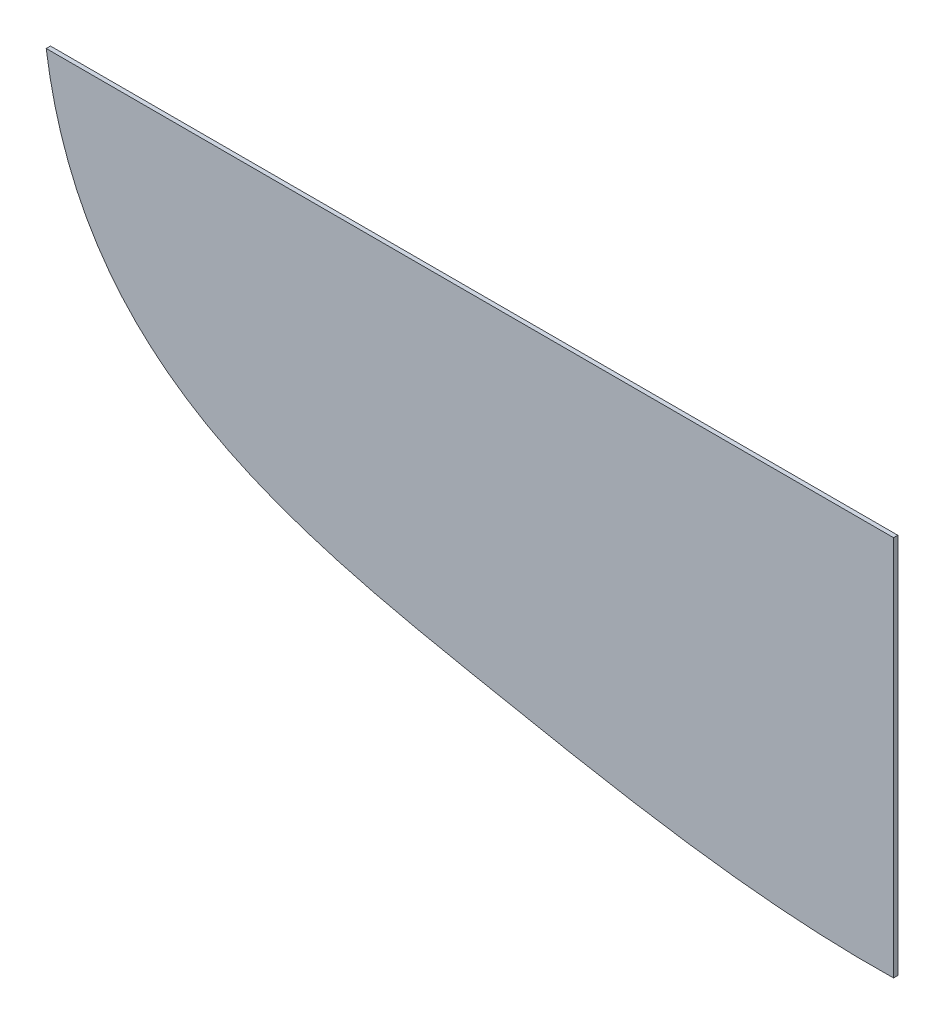
ISO-10303-21;
HEADER;
FILE_DESCRIPTION(('STEP AP214'),'2;1');
FILE_NAME('part.step','',(''),(''),'','','');
FILE_SCHEMA(('AUTOMOTIVE_DESIGN { 1 0 10303 214 1 1 1 1 }'));
ENDSEC;
DATA;
#1=APPLICATION_CONTEXT('core data for automotive mechanical design processes');
#2=APPLICATION_PROTOCOL_DEFINITION('international standard','automotive_design',2000,#1);
#3=PRODUCT_CONTEXT('',#1,'mechanical');
#4=PRODUCT('Part','Part','',(#3));
#5=PRODUCT_RELATED_PRODUCT_CATEGORY('part','',(#4));
#6=PRODUCT_DEFINITION_FORMATION('','',#4);
#7=PRODUCT_DEFINITION_CONTEXT('part definition',#1,'design');
#8=PRODUCT_DEFINITION('design','',#6,#7);
#9=PRODUCT_DEFINITION_SHAPE('','',#8);
#10=(LENGTH_UNIT() NAMED_UNIT(*) SI_UNIT(.MILLI.,.METRE.));
#11=(NAMED_UNIT(*) PLANE_ANGLE_UNIT() SI_UNIT($,.RADIAN.));
#12=(NAMED_UNIT(*) SI_UNIT($,.STERADIAN.) SOLID_ANGLE_UNIT());
#13=UNCERTAINTY_MEASURE_WITH_UNIT(LENGTH_MEASURE(1.E-05),#10,'distance_accuracy_value','');
#14=(GEOMETRIC_REPRESENTATION_CONTEXT(3) GLOBAL_UNCERTAINTY_ASSIGNED_CONTEXT((#13)) GLOBAL_UNIT_ASSIGNED_CONTEXT((#10,
#11,#12)) REPRESENTATION_CONTEXT('',''));
#15=CARTESIAN_POINT('',(0.,0.,0.));
#16=DIRECTION('',(0.,0.,1.));
#17=DIRECTION('',(1.,0.,0.));
#18=AXIS2_PLACEMENT_3D('',#15,#16,#17);
#19=CARTESIAN_POINT('',(0.,0.,0.1));
#20=DIRECTION('',(0.,-1.,0.));
#21=DIRECTION('',(0.,0.,-1.));
#22=AXIS2_PLACEMENT_3D('',#19,#20,#21);
#23=PLANE('',#22);
#24=DIRECTION('',(-1.,0.,0.));
#25=VECTOR('',#24,1.);
#26=CARTESIAN_POINT('',(0.,0.,-0.1));
#27=LINE('',#26,#25);
#28=CARTESIAN_POINT('',(0.,0.,-0.1));
#29=VERTEX_POINT('',#28);
#30=CARTESIAN_POINT('',(-40.,0.,-0.1));
#31=VERTEX_POINT('',#30);
#32=EDGE_CURVE('E85',#29,#31,#27,.T.);
#33=ORIENTED_EDGE('',*,*,#32,.T.);
#34=DIRECTION('',(0.,0.,-1.));
#35=VECTOR('',#34,1.);
#36=CARTESIAN_POINT('',(-40.,0.,0.1));
#37=LINE('',#36,#35);
#38=CARTESIAN_POINT('',(-40.,0.,0.1));
#39=VERTEX_POINT('',#38);
#40=EDGE_CURVE('E11',#39,#31,#37,.T.);
#41=ORIENTED_EDGE('',*,*,#40,.F.);
#42=DIRECTION('',(-1.,0.,0.));
#43=VECTOR('',#42,1.);
#44=CARTESIAN_POINT('',(0.,0.,0.1));
#45=LINE('',#44,#43);
#46=CARTESIAN_POINT('',(0.,0.,0.1));
#47=VERTEX_POINT('',#46);
#48=EDGE_CURVE('E78',#47,#39,#45,.T.);
#49=ORIENTED_EDGE('',*,*,#48,.F.);
#50=DIRECTION('',(0.,0.,-1.));
#51=VECTOR('',#50,1.);
#52=CARTESIAN_POINT('',(0.,0.,0.1));
#53=LINE('',#52,#51);
#54=EDGE_CURVE('E86',#47,#29,#53,.T.);
#55=ORIENTED_EDGE('',*,*,#54,.T.);
#56=EDGE_LOOP('',(#33,#41,#49,#55));
#57=FACE_BOUND('',#56,.T.);
#58=ADVANCED_FACE('F38',(#57),#23,.F.);
#59=CARTESIAN_POINT('',(-40.,0.,0.1));
#60=CARTESIAN_POINT('',(-38.330674914818,-11.7943779653592,0.1));
#61=CARTESIAN_POINT('',(-21.6040494946792,-15.2108656728393,0.1));
#62=CARTESIAN_POINT('',(-6.57706313451297,-18.1296657142858,0.1));
#63=CARTESIAN_POINT('',(0.,-18.,0.1));
#64=B_SPLINE_CURVE_WITH_KNOTS('',3,(#59,#60,#61,#62,#63),.UNSPECIFIED.,.F.,.F.,(4,1,4),(0.,
0.585812167027901,1.),.UNSPECIFIED.);
#65=DIRECTION('',(0.,0.,-1.));
#66=VECTOR('',#65,1.);
#67=SURFACE_OF_LINEAR_EXTRUSION('',#64,#66);
#68=CARTESIAN_POINT('',(-40.,0.,-0.1));
#69=CARTESIAN_POINT('',(-38.330674914818,-11.7943779653592,-0.1));
#70=CARTESIAN_POINT('',(-21.6040494946792,-15.2108656728393,-0.1));
#71=CARTESIAN_POINT('',(-6.57706313451297,-18.1296657142858,-0.1));
#72=CARTESIAN_POINT('',(0.,-18.,-0.1));
#73=B_SPLINE_CURVE_WITH_KNOTS('',3,(#68,#69,#70,#71,#72),.UNSPECIFIED.,.F.,.F.,(4,1,4),(0.,
0.585812167027901,1.),.UNSPECIFIED.);
#74=CARTESIAN_POINT('',(0.,-18.,-0.1));
#75=VERTEX_POINT('',#74);
#76=EDGE_CURVE('E66',#31,#75,#73,.T.);
#77=ORIENTED_EDGE('',*,*,#76,.T.);
#78=DIRECTION('',(0.,0.,-1.));
#79=VECTOR('',#78,1.);
#80=CARTESIAN_POINT('',(0.,-18.,0.1));
#81=LINE('',#80,#79);
#82=CARTESIAN_POINT('',(0.,-18.,0.1));
#83=VERTEX_POINT('',#82);
#84=EDGE_CURVE('E46',#83,#75,#81,.T.);
#85=ORIENTED_EDGE('',*,*,#84,.F.);
#86=EDGE_CURVE('E74',#39,#83,#64,.T.);
#87=ORIENTED_EDGE('',*,*,#86,.F.);
#88=ORIENTED_EDGE('',*,*,#40,.T.);
#89=EDGE_LOOP('',(#77,#85,#87,#88));
#90=FACE_BOUND('',#89,.T.);
#91=ADVANCED_FACE('F75',(#90),#67,.F.);
#92=CARTESIAN_POINT('',(0.,0.,0.1));
#93=DIRECTION('',(-1.,0.,0.));
#94=DIRECTION('',(0.,-1.,0.));
#95=AXIS2_PLACEMENT_3D('',#92,#93,#94);
#96=PLANE('',#95);
#97=DIRECTION('',(0.,1.,0.));
#98=VECTOR('',#97,1.);
#99=CARTESIAN_POINT('',(0.,0.,-0.1));
#100=LINE('',#99,#98);
#101=EDGE_CURVE('E71',#75,#29,#100,.T.);
#102=ORIENTED_EDGE('',*,*,#101,.T.);
#103=ORIENTED_EDGE('',*,*,#54,.F.);
#104=DIRECTION('',(0.,1.,0.));
#105=VECTOR('',#104,1.);
#106=CARTESIAN_POINT('',(0.,0.,0.1));
#107=LINE('',#106,#105);
#108=EDGE_CURVE('E54',#83,#47,#107,.T.);
#109=ORIENTED_EDGE('',*,*,#108,.F.);
#110=ORIENTED_EDGE('',*,*,#84,.T.);
#111=EDGE_LOOP('',(#102,#103,#109,#110));
#112=FACE_BOUND('',#111,.T.);
#113=ADVANCED_FACE('F98',(#112),#96,.F.);
#114=CARTESIAN_POINT('',(-23.3765126161658,-14.7807121899129,0.1));
#115=DIRECTION('',(0.,0.,-1.));
#116=DIRECTION('',(-1.,0.,0.));
#117=AXIS2_PLACEMENT_3D('',#114,#115,#116);
#118=PLANE('',#117);
#119=ORIENTED_EDGE('',*,*,#48,.T.);
#120=ORIENTED_EDGE('',*,*,#86,.T.);
#121=ORIENTED_EDGE('',*,*,#108,.T.);
#122=EDGE_LOOP('',(#119,#120,#121));
#123=FACE_BOUND('',#122,.T.);
#124=ADVANCED_FACE('F81',(#123),#118,.F.);
#125=CARTESIAN_POINT('',(-23.3765126161658,-14.7807121899129,-0.1));
#126=DIRECTION('',(0.,0.,-1.));
#127=DIRECTION('',(-1.,0.,0.));
#128=AXIS2_PLACEMENT_3D('',#125,#126,#127);
#129=PLANE('',#128);
#130=ORIENTED_EDGE('',*,*,#32,.F.);
#131=ORIENTED_EDGE('',*,*,#101,.F.);
#132=ORIENTED_EDGE('',*,*,#76,.F.);
#133=EDGE_LOOP('',(#130,#131,#132));
#134=FACE_BOUND('',#133,.T.);
#135=ADVANCED_FACE('F99',(#134),#129,.T.);
#136=CLOSED_SHELL('',(#58,#91,#113,#124,#135));
#137=MANIFOLD_SOLID_BREP('B2',#136);
#138=ADVANCED_BREP_SHAPE_REPRESENTATION('',(#18,#137),#14);
#139=SHAPE_DEFINITION_REPRESENTATION(#9,#138);
ENDSEC;
END-ISO-10303-21;
